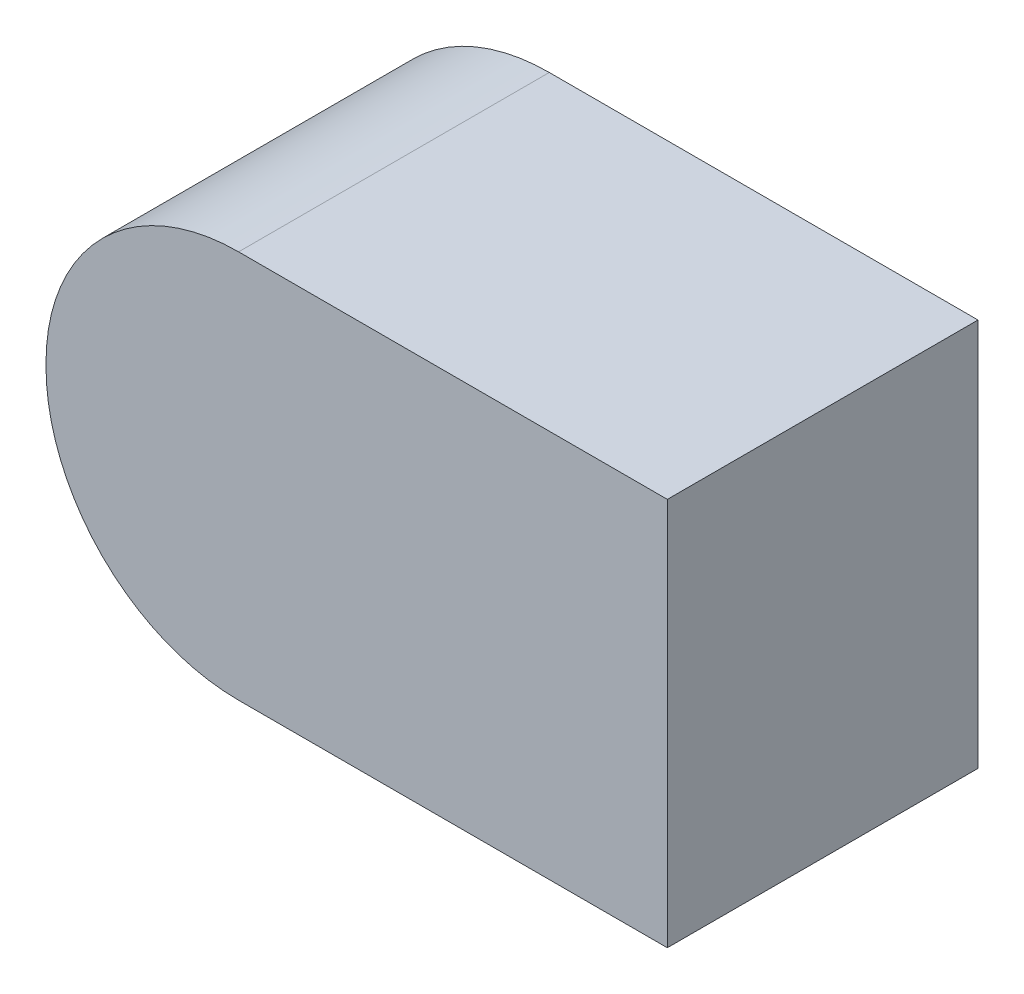
ISO-10303-21;
HEADER;
FILE_DESCRIPTION(('STEP AP214'),'2;1');
FILE_NAME('part.step','',(''),(''),'','','');
FILE_SCHEMA(('AUTOMOTIVE_DESIGN { 1 0 10303 214 1 1 1 1 }'));
ENDSEC;
DATA;
#1=APPLICATION_CONTEXT('core data for automotive mechanical design processes');
#2=APPLICATION_PROTOCOL_DEFINITION('international standard','automotive_design',2000,#1);
#3=PRODUCT_CONTEXT('',#1,'mechanical');
#4=PRODUCT('Part','Part','',(#3));
#5=PRODUCT_RELATED_PRODUCT_CATEGORY('part','',(#4));
#6=PRODUCT_DEFINITION_FORMATION('','',#4);
#7=PRODUCT_DEFINITION_CONTEXT('part definition',#1,'design');
#8=PRODUCT_DEFINITION('design','',#6,#7);
#9=PRODUCT_DEFINITION_SHAPE('','',#8);
#10=(LENGTH_UNIT() NAMED_UNIT(*) SI_UNIT(.MILLI.,.METRE.));
#11=(NAMED_UNIT(*) PLANE_ANGLE_UNIT() SI_UNIT($,.RADIAN.));
#12=(NAMED_UNIT(*) SI_UNIT($,.STERADIAN.) SOLID_ANGLE_UNIT());
#13=UNCERTAINTY_MEASURE_WITH_UNIT(LENGTH_MEASURE(1.E-05),#10,'distance_accuracy_value','');
#14=(GEOMETRIC_REPRESENTATION_CONTEXT(3) GLOBAL_UNCERTAINTY_ASSIGNED_CONTEXT((#13)) GLOBAL_UNIT_ASSIGNED_CONTEXT((#10,
#11,#12)) REPRESENTATION_CONTEXT('',''));
#15=CARTESIAN_POINT('',(0.,0.,0.));
#16=DIRECTION('',(0.,0.,1.));
#17=DIRECTION('',(1.,0.,0.));
#18=AXIS2_PLACEMENT_3D('',#15,#16,#17);
#19=CARTESIAN_POINT('',(-0.076,-0.001,0.));
#20=DIRECTION('',(0.,0.,1.));
#21=DIRECTION('',(1.,0.,0.));
#22=AXIS2_PLACEMENT_3D('',#19,#20,#21);
#23=PLANE('',#22);
#24=DIRECTION('',(0.,1.,0.));
#25=VECTOR('',#24,1.);
#26=CARTESIAN_POINT('',(0.2,0.125,0.));
#27=LINE('',#26,#25);
#28=CARTESIAN_POINT('',(0.2,-0.125,0.));
#29=VERTEX_POINT('',#28);
#30=CARTESIAN_POINT('',(0.2,0.125,0.));
#31=VERTEX_POINT('',#30);
#32=EDGE_CURVE('E130',#29,#31,#27,.T.);
#33=ORIENTED_EDGE('',*,*,#32,.F.);
#34=DIRECTION('',(1.,0.,0.));
#35=VECTOR('',#34,1.);
#36=CARTESIAN_POINT('',(-0.076,-0.125,0.));
#37=LINE('',#36,#35);
#38=CARTESIAN_POINT('',(-0.076,-0.125,0.));
#39=VERTEX_POINT('',#38);
#40=EDGE_CURVE('E26',#39,#29,#37,.T.);
#41=ORIENTED_EDGE('',*,*,#40,.F.);
#42=CARTESIAN_POINT('',(-0.076,-0.001,0.));
#43=DIRECTION('',(0.,0.,1.));
#44=DIRECTION('',(1.,0.,0.));
#45=AXIS2_PLACEMENT_3D('',#42,#43,#44);
#46=CIRCLE('',#45,0.124);
#47=CARTESIAN_POINT('',(-0.2,-0.001,0.));
#48=VERTEX_POINT('',#47);
#49=EDGE_CURVE('E93',#48,#39,#46,.T.);
#50=ORIENTED_EDGE('',*,*,#49,.F.);
#51=DIRECTION('',(0.,-1.,0.));
#52=VECTOR('',#51,1.);
#53=CARTESIAN_POINT('',(-0.2,0.001,0.));
#54=LINE('',#53,#52);
#55=CARTESIAN_POINT('',(-0.2,0.001,0.));
#56=VERTEX_POINT('',#55);
#57=EDGE_CURVE('E96',#56,#48,#54,.T.);
#58=ORIENTED_EDGE('',*,*,#57,.F.);
#59=CARTESIAN_POINT('',(-0.076,0.001,0.));
#60=DIRECTION('',(0.,0.,1.));
#61=DIRECTION('',(1.,0.,0.));
#62=AXIS2_PLACEMENT_3D('',#59,#60,#61);
#63=CIRCLE('',#62,0.124);
#64=CARTESIAN_POINT('',(-0.076,0.125,0.));
#65=VERTEX_POINT('',#64);
#66=EDGE_CURVE('E110',#65,#56,#63,.T.);
#67=ORIENTED_EDGE('',*,*,#66,.F.);
#68=DIRECTION('',(-1.,0.,0.));
#69=VECTOR('',#68,1.);
#70=CARTESIAN_POINT('',(-0.076,0.125,0.));
#71=LINE('',#70,#69);
#72=EDGE_CURVE('E133',#31,#65,#71,.T.);
#73=ORIENTED_EDGE('',*,*,#72,.F.);
#74=EDGE_LOOP('',(#33,#41,#50,#58,#67,#73));
#75=FACE_BOUND('',#74,.T.);
#76=ADVANCED_FACE('F17',(#75),#23,.F.);
#77=CARTESIAN_POINT('',(-0.076,-0.001,0.2));
#78=DIRECTION('',(0.,0.,1.));
#79=DIRECTION('',(1.,0.,0.));
#80=AXIS2_PLACEMENT_3D('',#77,#78,#79);
#81=PLANE('',#80);
#82=DIRECTION('',(0.,1.,0.));
#83=VECTOR('',#82,1.);
#84=CARTESIAN_POINT('',(0.2,0.125,0.2));
#85=LINE('',#84,#83);
#86=CARTESIAN_POINT('',(0.2,-0.125,0.2));
#87=VERTEX_POINT('',#86);
#88=CARTESIAN_POINT('',(0.2,0.125,0.2));
#89=VERTEX_POINT('',#88);
#90=EDGE_CURVE('E131',#87,#89,#85,.T.);
#91=ORIENTED_EDGE('',*,*,#90,.T.);
#92=DIRECTION('',(-1.,0.,0.));
#93=VECTOR('',#92,1.);
#94=CARTESIAN_POINT('',(-0.076,0.125,0.2));
#95=LINE('',#94,#93);
#96=CARTESIAN_POINT('',(-0.076,0.125,0.2));
#97=VERTEX_POINT('',#96);
#98=EDGE_CURVE('E106',#89,#97,#95,.T.);
#99=ORIENTED_EDGE('',*,*,#98,.T.);
#100=CARTESIAN_POINT('',(-0.076,0.001,0.2));
#101=DIRECTION('',(0.,0.,1.));
#102=DIRECTION('',(1.,0.,0.));
#103=AXIS2_PLACEMENT_3D('',#100,#101,#102);
#104=CIRCLE('',#103,0.124);
#105=CARTESIAN_POINT('',(-0.2,0.001,0.2));
#106=VERTEX_POINT('',#105);
#107=EDGE_CURVE('E88',#97,#106,#104,.T.);
#108=ORIENTED_EDGE('',*,*,#107,.T.);
#109=DIRECTION('',(0.,-1.,0.));
#110=VECTOR('',#109,1.);
#111=CARTESIAN_POINT('',(-0.2,0.001,0.2));
#112=LINE('',#111,#110);
#113=CARTESIAN_POINT('',(-0.2,-0.001,0.2));
#114=VERTEX_POINT('',#113);
#115=EDGE_CURVE('E84',#106,#114,#112,.T.);
#116=ORIENTED_EDGE('',*,*,#115,.T.);
#117=CARTESIAN_POINT('',(-0.076,-0.001,0.2));
#118=DIRECTION('',(0.,0.,1.));
#119=DIRECTION('',(1.,0.,0.));
#120=AXIS2_PLACEMENT_3D('',#117,#118,#119);
#121=CIRCLE('',#120,0.124);
#122=CARTESIAN_POINT('',(-0.076,-0.125,0.2));
#123=VERTEX_POINT('',#122);
#124=EDGE_CURVE('E71',#114,#123,#121,.T.);
#125=ORIENTED_EDGE('',*,*,#124,.T.);
#126=DIRECTION('',(1.,0.,0.));
#127=VECTOR('',#126,1.);
#128=CARTESIAN_POINT('',(-0.076,-0.125,0.2));
#129=LINE('',#128,#127);
#130=EDGE_CURVE('E11',#123,#87,#129,.T.);
#131=ORIENTED_EDGE('',*,*,#130,.T.);
#132=EDGE_LOOP('',(#91,#99,#108,#116,#125,#131));
#133=FACE_BOUND('',#132,.T.);
#134=ADVANCED_FACE('F86',(#133),#81,.T.);
#135=CARTESIAN_POINT('',(-0.076,-0.125,0.2));
#136=DIRECTION('',(0.,1.,0.));
#137=DIRECTION('',(1.,0.,0.));
#138=AXIS2_PLACEMENT_3D('',#135,#136,#137);
#139=PLANE('',#138);
#140=ORIENTED_EDGE('',*,*,#40,.T.);
#141=DIRECTION('',(0.,0.,-1.));
#142=VECTOR('',#141,1.);
#143=CARTESIAN_POINT('',(0.2,-0.125,0.2));
#144=LINE('',#143,#142);
#145=EDGE_CURVE('E120',#87,#29,#144,.T.);
#146=ORIENTED_EDGE('',*,*,#145,.F.);
#147=ORIENTED_EDGE('',*,*,#130,.F.);
#148=DIRECTION('',(0.,0.,-1.));
#149=VECTOR('',#148,1.);
#150=CARTESIAN_POINT('',(-0.076,-0.125,0.2));
#151=LINE('',#150,#149);
#152=EDGE_CURVE('E78',#123,#39,#151,.T.);
#153=ORIENTED_EDGE('',*,*,#152,.T.);
#154=EDGE_LOOP('',(#140,#146,#147,#153));
#155=FACE_BOUND('',#154,.T.);
#156=ADVANCED_FACE('F119',(#155),#139,.F.);
#157=CARTESIAN_POINT('',(-0.076,-0.001,0.2));
#158=DIRECTION('',(0.,0.,-1.));
#159=DIRECTION('',(-1.,0.,0.));
#160=AXIS2_PLACEMENT_3D('',#157,#158,#159);
#161=CYLINDRICAL_SURFACE('',#160,0.124);
#162=ORIENTED_EDGE('',*,*,#49,.T.);
#163=ORIENTED_EDGE('',*,*,#152,.F.);
#164=ORIENTED_EDGE('',*,*,#124,.F.);
#165=DIRECTION('',(0.,0.,-1.));
#166=VECTOR('',#165,1.);
#167=CARTESIAN_POINT('',(-0.2,-0.001,0.2));
#168=LINE('',#167,#166);
#169=EDGE_CURVE('E76',#114,#48,#168,.T.);
#170=ORIENTED_EDGE('',*,*,#169,.T.);
#171=EDGE_LOOP('',(#162,#163,#164,#170));
#172=FACE_BOUND('',#171,.T.);
#173=ADVANCED_FACE('F74',(#172),#161,.T.);
#174=CARTESIAN_POINT('',(-0.2,0.001,0.2));
#175=DIRECTION('',(1.,0.,0.));
#176=DIRECTION('',(0.,1.,0.));
#177=AXIS2_PLACEMENT_3D('',#174,#175,#176);
#178=PLANE('',#177);
#179=ORIENTED_EDGE('',*,*,#57,.T.);
#180=ORIENTED_EDGE('',*,*,#169,.F.);
#181=ORIENTED_EDGE('',*,*,#115,.F.);
#182=DIRECTION('',(0.,0.,-1.));
#183=VECTOR('',#182,1.);
#184=CARTESIAN_POINT('',(-0.2,0.001,0.2));
#185=LINE('',#184,#183);
#186=EDGE_CURVE('E108',#106,#56,#185,.T.);
#187=ORIENTED_EDGE('',*,*,#186,.T.);
#188=EDGE_LOOP('',(#179,#180,#181,#187));
#189=FACE_BOUND('',#188,.T.);
#190=ADVANCED_FACE('F95',(#189),#178,.F.);
#191=CARTESIAN_POINT('',(-0.076,0.001,0.2));
#192=DIRECTION('',(0.,0.,-1.));
#193=DIRECTION('',(-1.,0.,0.));
#194=AXIS2_PLACEMENT_3D('',#191,#192,#193);
#195=CYLINDRICAL_SURFACE('',#194,0.124);
#196=ORIENTED_EDGE('',*,*,#66,.T.);
#197=ORIENTED_EDGE('',*,*,#186,.F.);
#198=ORIENTED_EDGE('',*,*,#107,.F.);
#199=DIRECTION('',(0.,0.,-1.));
#200=VECTOR('',#199,1.);
#201=CARTESIAN_POINT('',(-0.076,0.125,0.2));
#202=LINE('',#201,#200);
#203=EDGE_CURVE('E155',#97,#65,#202,.T.);
#204=ORIENTED_EDGE('',*,*,#203,.T.);
#205=EDGE_LOOP('',(#196,#197,#198,#204));
#206=FACE_BOUND('',#205,.T.);
#207=ADVANCED_FACE('F214',(#206),#195,.T.);
#208=CARTESIAN_POINT('',(-0.076,0.125,0.2));
#209=DIRECTION('',(0.,-1.,0.));
#210=DIRECTION('',(0.,0.,-1.));
#211=AXIS2_PLACEMENT_3D('',#208,#209,#210);
#212=PLANE('',#211);
#213=ORIENTED_EDGE('',*,*,#72,.T.);
#214=ORIENTED_EDGE('',*,*,#203,.F.);
#215=ORIENTED_EDGE('',*,*,#98,.F.);
#216=DIRECTION('',(0.,0.,-1.));
#217=VECTOR('',#216,1.);
#218=CARTESIAN_POINT('',(0.2,0.125,0.2));
#219=LINE('',#218,#217);
#220=EDGE_CURVE('E139',#89,#31,#219,.T.);
#221=ORIENTED_EDGE('',*,*,#220,.T.);
#222=EDGE_LOOP('',(#213,#214,#215,#221));
#223=FACE_BOUND('',#222,.T.);
#224=ADVANCED_FACE('F166',(#223),#212,.F.);
#225=CARTESIAN_POINT('',(0.2,0.125,0.2));
#226=DIRECTION('',(-1.,0.,0.));
#227=DIRECTION('',(0.,1.,0.));
#228=AXIS2_PLACEMENT_3D('',#225,#226,#227);
#229=PLANE('',#228);
#230=ORIENTED_EDGE('',*,*,#32,.T.);
#231=ORIENTED_EDGE('',*,*,#220,.F.);
#232=ORIENTED_EDGE('',*,*,#90,.F.);
#233=ORIENTED_EDGE('',*,*,#145,.T.);
#234=EDGE_LOOP('',(#230,#231,#232,#233));
#235=FACE_BOUND('',#234,.T.);
#236=ADVANCED_FACE('F128',(#235),#229,.F.);
#237=CLOSED_SHELL('',(#76,#134,#156,#173,#190,#207,#224,#236));
#238=MANIFOLD_SOLID_BREP('B1',#237);
#239=ADVANCED_BREP_SHAPE_REPRESENTATION('',(#18,#238),#14);
#240=SHAPE_DEFINITION_REPRESENTATION(#9,#239);
ENDSEC;
END-ISO-10303-21;
